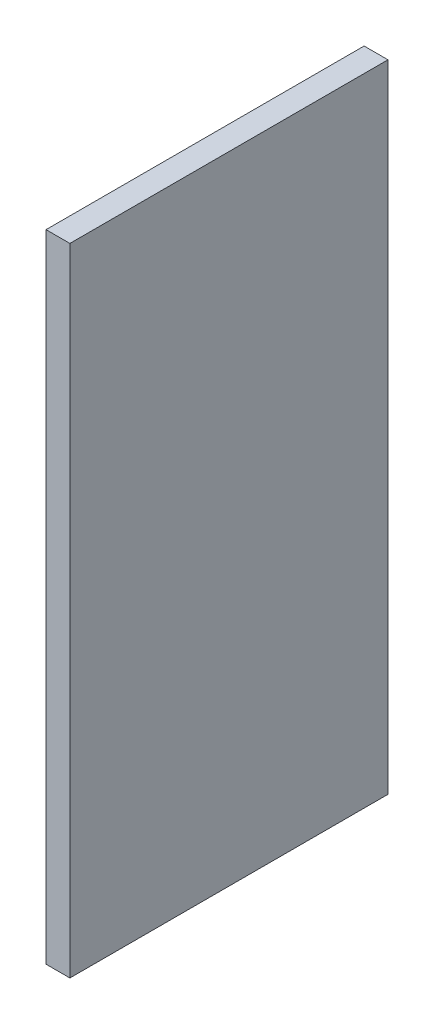
ISO-10303-21;
HEADER;
FILE_DESCRIPTION(('STEP AP214'),'2;1');
FILE_NAME('part.step','',(''),(''),'','','');
FILE_SCHEMA(('AUTOMOTIVE_DESIGN { 1 0 10303 214 1 1 1 1 }'));
ENDSEC;
DATA;
#1=APPLICATION_CONTEXT('core data for automotive mechanical design processes');
#2=APPLICATION_PROTOCOL_DEFINITION('international standard','automotive_design',2000,#1);
#3=PRODUCT_CONTEXT('',#1,'mechanical');
#4=PRODUCT('Part','Part','',(#3));
#5=PRODUCT_RELATED_PRODUCT_CATEGORY('part','',(#4));
#6=PRODUCT_DEFINITION_FORMATION('','',#4);
#7=PRODUCT_DEFINITION_CONTEXT('part definition',#1,'design');
#8=PRODUCT_DEFINITION('design','',#6,#7);
#9=PRODUCT_DEFINITION_SHAPE('','',#8);
#10=(LENGTH_UNIT() NAMED_UNIT(*) SI_UNIT(.MILLI.,.METRE.));
#11=(NAMED_UNIT(*) PLANE_ANGLE_UNIT() SI_UNIT($,.RADIAN.));
#12=(NAMED_UNIT(*) SI_UNIT($,.STERADIAN.) SOLID_ANGLE_UNIT());
#13=UNCERTAINTY_MEASURE_WITH_UNIT(LENGTH_MEASURE(1.E-05),#10,'distance_accuracy_value','');
#14=(GEOMETRIC_REPRESENTATION_CONTEXT(3) GLOBAL_UNCERTAINTY_ASSIGNED_CONTEXT((#13)) GLOBAL_UNIT_ASSIGNED_CONTEXT((#10,
#11,#12)) REPRESENTATION_CONTEXT('',''));
#15=CARTESIAN_POINT('',(0.,0.,0.));
#16=DIRECTION('',(0.,0.,1.));
#17=DIRECTION('',(1.,0.,0.));
#18=AXIS2_PLACEMENT_3D('',#15,#16,#17);
#19=CARTESIAN_POINT('',(0.,160.,80.));
#20=DIRECTION('',(1.,0.,0.));
#21=DIRECTION('',(0.,1.,0.));
#22=AXIS2_PLACEMENT_3D('',#19,#20,#21);
#23=PLANE('',#22);
#24=DIRECTION('',(0.,-1.,0.));
#25=VECTOR('',#24,1.);
#26=CARTESIAN_POINT('',(0.,160.,0.));
#27=LINE('',#26,#25);
#28=CARTESIAN_POINT('',(0.,160.,0.));
#29=VERTEX_POINT('',#28);
#30=CARTESIAN_POINT('',(0.,0.,0.));
#31=VERTEX_POINT('',#30);
#32=EDGE_CURVE('E96',#29,#31,#27,.T.);
#33=ORIENTED_EDGE('',*,*,#32,.T.);
#34=DIRECTION('',(0.,0.,-1.));
#35=VECTOR('',#34,1.);
#36=CARTESIAN_POINT('',(0.,0.,80.));
#37=LINE('',#36,#35);
#38=CARTESIAN_POINT('',(0.,0.,80.));
#39=VERTEX_POINT('',#38);
#40=EDGE_CURVE('E11',#39,#31,#37,.T.);
#41=ORIENTED_EDGE('',*,*,#40,.F.);
#42=DIRECTION('',(0.,-1.,0.));
#43=VECTOR('',#42,1.);
#44=CARTESIAN_POINT('',(0.,160.,80.));
#45=LINE('',#44,#43);
#46=CARTESIAN_POINT('',(0.,160.,80.));
#47=VERTEX_POINT('',#46);
#48=EDGE_CURVE('E84',#47,#39,#45,.T.);
#49=ORIENTED_EDGE('',*,*,#48,.F.);
#50=DIRECTION('',(0.,0.,-1.));
#51=VECTOR('',#50,1.);
#52=CARTESIAN_POINT('',(0.,160.,80.));
#53=LINE('',#52,#51);
#54=EDGE_CURVE('E92',#47,#29,#53,.T.);
#55=ORIENTED_EDGE('',*,*,#54,.T.);
#56=EDGE_LOOP('',(#33,#41,#49,#55));
#57=FACE_BOUND('',#56,.T.);
#58=ADVANCED_FACE('F33',(#57),#23,.F.);
#59=CARTESIAN_POINT('',(0.,0.,80.));
#60=DIRECTION('',(0.,1.,0.));
#61=DIRECTION('',(0.,0.,1.));
#62=AXIS2_PLACEMENT_3D('',#59,#60,#61);
#63=PLANE('',#62);
#64=DIRECTION('',(1.,0.,0.));
#65=VECTOR('',#64,1.);
#66=CARTESIAN_POINT('',(0.,0.,0.));
#67=LINE('',#66,#65);
#68=CARTESIAN_POINT('',(6.00000000000001,0.,0.));
#69=VERTEX_POINT('',#68);
#70=EDGE_CURVE('E88',#31,#69,#67,.T.);
#71=ORIENTED_EDGE('',*,*,#70,.T.);
#72=DIRECTION('',(0.,0.,-1.));
#73=VECTOR('',#72,1.);
#74=CARTESIAN_POINT('',(6.00000000000001,0.,80.));
#75=LINE('',#74,#73);
#76=CARTESIAN_POINT('',(6.00000000000001,0.,80.));
#77=VERTEX_POINT('',#76);
#78=EDGE_CURVE('E41',#77,#69,#75,.T.);
#79=ORIENTED_EDGE('',*,*,#78,.F.);
#80=DIRECTION('',(1.,0.,0.));
#81=VECTOR('',#80,1.);
#82=CARTESIAN_POINT('',(0.,0.,80.));
#83=LINE('',#82,#81);
#84=EDGE_CURVE('E79',#39,#77,#83,.T.);
#85=ORIENTED_EDGE('',*,*,#84,.F.);
#86=ORIENTED_EDGE('',*,*,#40,.T.);
#87=EDGE_LOOP('',(#71,#79,#85,#86));
#88=FACE_BOUND('',#87,.T.);
#89=ADVANCED_FACE('F87',(#88),#63,.F.);
#90=CARTESIAN_POINT('',(5.99999999999998,160.,80.));
#91=DIRECTION('',(-1.,0.,0.));
#92=DIRECTION('',(0.,-1.,0.));
#93=AXIS2_PLACEMENT_3D('',#90,#91,#92);
#94=PLANE('',#93);
#95=DIRECTION('',(0.,1.,0.));
#96=VECTOR('',#95,1.);
#97=CARTESIAN_POINT('',(5.99999999999998,160.,0.));
#98=LINE('',#97,#96);
#99=CARTESIAN_POINT('',(5.99999999999998,160.,0.));
#100=VERTEX_POINT('',#99);
#101=EDGE_CURVE('E66',#69,#100,#98,.T.);
#102=ORIENTED_EDGE('',*,*,#101,.T.);
#103=DIRECTION('',(0.,0.,-1.));
#104=VECTOR('',#103,1.);
#105=CARTESIAN_POINT('',(5.99999999999998,160.,80.));
#106=LINE('',#105,#104);
#107=CARTESIAN_POINT('',(5.99999999999998,160.,80.));
#108=VERTEX_POINT('',#107);
#109=EDGE_CURVE('E89',#108,#100,#106,.T.);
#110=ORIENTED_EDGE('',*,*,#109,.F.);
#111=DIRECTION('',(0.,1.,0.));
#112=VECTOR('',#111,1.);
#113=CARTESIAN_POINT('',(5.99999999999998,160.,80.));
#114=LINE('',#113,#112);
#115=EDGE_CURVE('E82',#77,#108,#114,.T.);
#116=ORIENTED_EDGE('',*,*,#115,.F.);
#117=ORIENTED_EDGE('',*,*,#78,.T.);
#118=EDGE_LOOP('',(#102,#110,#116,#117));
#119=FACE_BOUND('',#118,.T.);
#120=ADVANCED_FACE('F90',(#119),#94,.F.);
#121=CARTESIAN_POINT('',(0.,160.,80.));
#122=DIRECTION('',(0.,-1.,0.));
#123=DIRECTION('',(0.,0.,-1.));
#124=AXIS2_PLACEMENT_3D('',#121,#122,#123);
#125=PLANE('',#124);
#126=DIRECTION('',(-1.,0.,0.));
#127=VECTOR('',#126,1.);
#128=CARTESIAN_POINT('',(0.,160.,0.));
#129=LINE('',#128,#127);
#130=EDGE_CURVE('E72',#100,#29,#129,.T.);
#131=ORIENTED_EDGE('',*,*,#130,.T.);
#132=ORIENTED_EDGE('',*,*,#54,.F.);
#133=DIRECTION('',(-1.,0.,0.));
#134=VECTOR('',#133,1.);
#135=CARTESIAN_POINT('',(0.,160.,80.));
#136=LINE('',#135,#134);
#137=EDGE_CURVE('E49',#108,#47,#136,.T.);
#138=ORIENTED_EDGE('',*,*,#137,.F.);
#139=ORIENTED_EDGE('',*,*,#109,.T.);
#140=EDGE_LOOP('',(#131,#132,#138,#139));
#141=FACE_BOUND('',#140,.T.);
#142=ADVANCED_FACE('F103',(#141),#125,.F.);
#143=CARTESIAN_POINT('',(0.,0.,80.));
#144=DIRECTION('',(0.,0.,1.));
#145=DIRECTION('',(1.,0.,0.));
#146=AXIS2_PLACEMENT_3D('',#143,#144,#145);
#147=PLANE('',#146);
#148=ORIENTED_EDGE('',*,*,#48,.T.);
#149=ORIENTED_EDGE('',*,*,#84,.T.);
#150=ORIENTED_EDGE('',*,*,#115,.T.);
#151=ORIENTED_EDGE('',*,*,#137,.T.);
#152=EDGE_LOOP('',(#148,#149,#150,#151));
#153=FACE_BOUND('',#152,.T.);
#154=ADVANCED_FACE('F80',(#153),#147,.T.);
#155=CARTESIAN_POINT('',(0.,0.,0.));
#156=DIRECTION('',(0.,0.,1.));
#157=DIRECTION('',(1.,0.,0.));
#158=AXIS2_PLACEMENT_3D('',#155,#156,#157);
#159=PLANE('',#158);
#160=ORIENTED_EDGE('',*,*,#32,.F.);
#161=ORIENTED_EDGE('',*,*,#130,.F.);
#162=ORIENTED_EDGE('',*,*,#101,.F.);
#163=ORIENTED_EDGE('',*,*,#70,.F.);
#164=EDGE_LOOP('',(#160,#161,#162,#163));
#165=FACE_BOUND('',#164,.T.);
#166=ADVANCED_FACE('F106',(#165),#159,.F.);
#167=CLOSED_SHELL('',(#58,#89,#120,#142,#154,#166));
#168=MANIFOLD_SOLID_BREP('B2',#167);
#169=ADVANCED_BREP_SHAPE_REPRESENTATION('',(#18,#168),#14);
#170=SHAPE_DEFINITION_REPRESENTATION(#9,#169);
ENDSEC;
END-ISO-10303-21;
